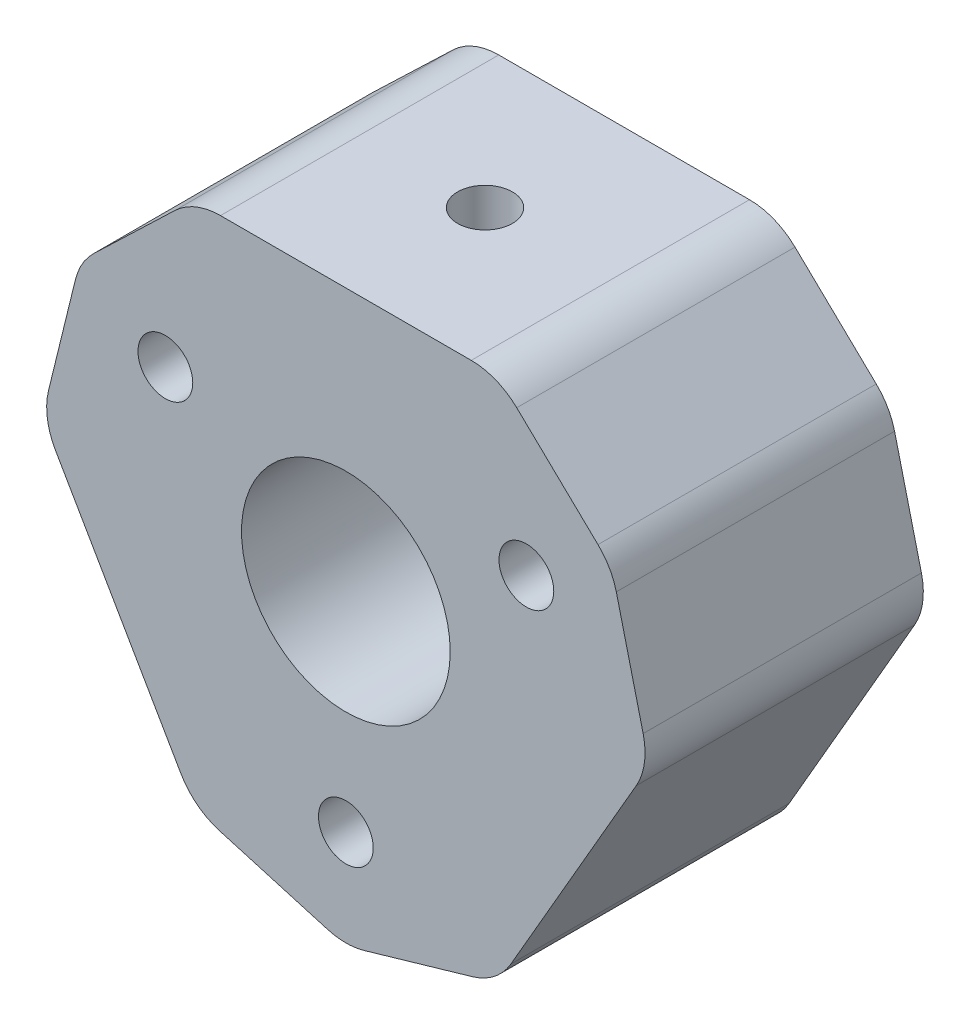
ISO-10303-21;
HEADER;
FILE_DESCRIPTION(('STEP AP214'),'2;1');
FILE_NAME('part.step','',(''),(''),'','','');
FILE_SCHEMA(('AUTOMOTIVE_DESIGN { 1 0 10303 214 1 1 1 1 }'));
ENDSEC;
DATA;
#1=APPLICATION_CONTEXT('core data for automotive mechanical design processes');
#2=APPLICATION_PROTOCOL_DEFINITION('international standard','automotive_design',2000,#1);
#3=PRODUCT_CONTEXT('',#1,'mechanical');
#4=PRODUCT('Part','Part','',(#3));
#5=PRODUCT_RELATED_PRODUCT_CATEGORY('part','',(#4));
#6=PRODUCT_DEFINITION_FORMATION('','',#4);
#7=PRODUCT_DEFINITION_CONTEXT('part definition',#1,'design');
#8=PRODUCT_DEFINITION('design','',#6,#7);
#9=PRODUCT_DEFINITION_SHAPE('','',#8);
#10=(LENGTH_UNIT() NAMED_UNIT(*) SI_UNIT(.MILLI.,.METRE.));
#11=(NAMED_UNIT(*) PLANE_ANGLE_UNIT() SI_UNIT($,.RADIAN.));
#12=(NAMED_UNIT(*) SI_UNIT($,.STERADIAN.) SOLID_ANGLE_UNIT());
#13=UNCERTAINTY_MEASURE_WITH_UNIT(LENGTH_MEASURE(1.E-05),#10,'distance_accuracy_value','');
#14=(GEOMETRIC_REPRESENTATION_CONTEXT(3) GLOBAL_UNCERTAINTY_ASSIGNED_CONTEXT((#13)) GLOBAL_UNIT_ASSIGNED_CONTEXT((#10,
#11,#12)) REPRESENTATION_CONTEXT('',''));
#15=CARTESIAN_POINT('',(0.,0.,0.));
#16=DIRECTION('',(0.,0.,1.));
#17=DIRECTION('',(1.,0.,0.));
#18=AXIS2_PLACEMENT_3D('',#15,#16,#17);
#19=CARTESIAN_POINT('',(0.,-10.888495471054,12.7));
#20=DIRECTION('',(0.,0.,1.));
#21=DIRECTION('',(1.,0.,0.));
#22=AXIS2_PLACEMENT_3D('',#19,#20,#21);
#23=PLANE('',#22);
#24=CARTESIAN_POINT('',(8.23806665349945,4.75625000000004,12.7));
#25=DIRECTION('',(0.,0.,1.));
#26=DIRECTION('',(1.,0.,0.));
#27=AXIS2_PLACEMENT_3D('',#24,#25,#26);
#28=CIRCLE('',#27,1.25);
#29=CARTESIAN_POINT('',(9.48806665349945,4.75625000000004,12.7));
#30=VERTEX_POINT('',#29);
#31=EDGE_CURVE('E392',#30,#30,#28,.T.);
#32=ORIENTED_EDGE('',*,*,#31,.F.);
#33=EDGE_LOOP('',(#32));
#34=FACE_BOUND('',#33,.T.);
#35=CARTESIAN_POINT('',(0.,0.,12.7));
#36=DIRECTION('',(0.,0.,1.));
#37=DIRECTION('',(1.,0.,0.));
#38=AXIS2_PLACEMENT_3D('',#35,#36,#37);
#39=CIRCLE('',#38,4.7625);
#40=CARTESIAN_POINT('',(4.7625,0.,12.7));
#41=VERTEX_POINT('',#40);
#42=EDGE_CURVE('E208',#41,#41,#39,.T.);
#43=ORIENTED_EDGE('',*,*,#42,.F.);
#44=EDGE_LOOP('',(#43));
#45=FACE_BOUND('',#44,.T.);
#46=CARTESIAN_POINT('',(0.,-10.888495471054,12.7));
#47=DIRECTION('',(0.,0.,1.));
#48=DIRECTION('',(1.,0.,0.));
#49=AXIS2_PLACEMENT_3D('',#46,#47,#48);
#50=CIRCLE('',#49,3.);
#51=CARTESIAN_POINT('',(-0.836847118322298,-13.7694131895173,12.7));
#52=VERTEX_POINT('',#51);
#53=CARTESIAN_POINT('',(0.836847118322313,-13.7694131895173,12.7));
#54=VERTEX_POINT('',#53);
#55=EDGE_CURVE('E239',#52,#54,#50,.T.);
#56=ORIENTED_EDGE('',*,*,#55,.T.);
#57=DIRECTION('',(0.960305906154426,0.278949039440768,0.));
#58=VECTOR('',#57,1.);
#59=CARTESIAN_POINT('',(0.836847118322313,-13.7694131895173,12.7));
#60=LINE('',#59,#58);
#61=CARTESIAN_POINT('',(5.77000843492431,-12.3364316761752,12.7));
#62=VERTEX_POINT('',#61);
#63=EDGE_CURVE('E137',#54,#62,#60,.T.);
#64=ORIENTED_EDGE('',*,*,#63,.T.);
#65=CARTESIAN_POINT('',(4.93316131660201,-9.45551395771196,12.7));
#66=DIRECTION('',(0.,0.,1.));
#67=DIRECTION('',(1.,0.,0.));
#68=AXIS2_PLACEMENT_3D('',#65,#66,#67);
#69=CIRCLE('',#68,3.);
#70=CARTESIAN_POINT('',(7.53123752795532,-10.955513957712,12.7));
#71=VERTEX_POINT('',#70);
#72=EDGE_CURVE('E284',#62,#71,#69,.T.);
#73=ORIENTED_EDGE('',*,*,#72,.T.);
#74=DIRECTION('',(0.499999999999999,0.866025403784439,0.));
#75=VECTOR('',#74,1.);
#76=CARTESIAN_POINT('',(7.53123752795532,-10.955513957712,12.7));
#77=LINE('',#76,#75);
#78=CARTESIAN_POINT('',(13.2533721628712,-1.04448604228802,12.7));
#79=VERTEX_POINT('',#78);
#80=EDGE_CURVE('E303',#71,#79,#77,.T.);
#81=ORIENTED_EDGE('',*,*,#80,.T.);
#82=CARTESIAN_POINT('',(10.6552959515179,0.455513957711976,12.7));
#83=DIRECTION('',(0.,0.,1.));
#84=DIRECTION('',(1.,0.,0.));
#85=AXIS2_PLACEMENT_3D('',#82,#83,#84);
#86=CIRCLE('',#85,3.);
#87=CARTESIAN_POINT('',(13.568667441081,1.17124195339269,12.7));
#88=VERTEX_POINT('',#87);
#89=EDGE_CURVE('E300',#79,#88,#86,.T.);
#90=ORIENTED_EDGE('',*,*,#89,.T.);
#91=DIRECTION('',(-0.238575998560237,0.971123829854353,0.));
#92=VECTOR('',#91,1.);
#93=CARTESIAN_POINT('',(12.3430851764877,6.15997573120774,12.7));
#94=LINE('',#93,#92);
#95=CARTESIAN_POINT('',(12.3430851764877,6.15997573120774,12.7));
#96=VERTEX_POINT('',#95);
#97=EDGE_CURVE('E302',#88,#96,#94,.T.);
#98=ORIENTED_EDGE('',*,*,#97,.T.);
#99=CARTESIAN_POINT('',(9.42971368692461,5.44424773552703,12.7));
#100=DIRECTION('',(0.,0.,1.));
#101=DIRECTION('',(-1.,0.,0.));
#102=AXIS2_PLACEMENT_3D('',#99,#100,#101);
#103=CIRCLE('',#102,3.);
#104=CARTESIAN_POINT('',(11.5062380581653,7.60943745830959,12.7));
#105=VERTEX_POINT('',#104);
#106=EDGE_CURVE('E305',#96,#105,#103,.T.);
#107=ORIENTED_EDGE('',*,*,#106,.T.);
#108=DIRECTION('',(-0.721729907594188,0.692174790413581,0.));
#109=VECTOR('',#108,1.);
#110=CARTESIAN_POINT('',(7.79865900615664,11.1651897227826,12.7));
#111=LINE('',#110,#109);
#112=CARTESIAN_POINT('',(7.79865900615664,11.1651897227826,12.7));
#113=VERTEX_POINT('',#112);
#114=EDGE_CURVE('E311',#105,#113,#111,.T.);
#115=ORIENTED_EDGE('',*,*,#114,.T.);
#116=CARTESIAN_POINT('',(5.7221346349159,9.,12.7));
#117=DIRECTION('',(0.,0.,1.));
#118=DIRECTION('',(1.,0.,0.));
#119=AXIS2_PLACEMENT_3D('',#116,#117,#118);
#120=CIRCLE('',#119,3.);
#121=CARTESIAN_POINT('',(5.7221346349159,12.,12.7));
#122=VERTEX_POINT('',#121);
#123=EDGE_CURVE('E313',#113,#122,#120,.T.);
#124=ORIENTED_EDGE('',*,*,#123,.T.);
#125=DIRECTION('',(-1.,0.,0.));
#126=VECTOR('',#125,1.);
#127=CARTESIAN_POINT('',(5.7221346349159,12.,12.7));
#128=LINE('',#127,#126);
#129=CARTESIAN_POINT('',(-5.7221346349159,12.,12.7));
#130=VERTEX_POINT('',#129);
#131=EDGE_CURVE('E315',#122,#130,#128,.T.);
#132=ORIENTED_EDGE('',*,*,#131,.T.);
#133=CARTESIAN_POINT('',(-5.7221346349159,9.,12.7));
#134=DIRECTION('',(0.,0.,1.));
#135=DIRECTION('',(1.,0.,0.));
#136=AXIS2_PLACEMENT_3D('',#133,#134,#135);
#137=CIRCLE('',#136,3.);
#138=CARTESIAN_POINT('',(-7.79865900615666,11.1651897227825,12.7));
#139=VERTEX_POINT('',#138);
#140=EDGE_CURVE('E317',#130,#139,#137,.T.);
#141=ORIENTED_EDGE('',*,*,#140,.T.);
#142=DIRECTION('',(-0.721729907594183,-0.692174790413586,0.));
#143=VECTOR('',#142,1.);
#144=CARTESIAN_POINT('',(-7.79865900615666,11.1651897227825,12.7));
#145=LINE('',#144,#143);
#146=CARTESIAN_POINT('',(-11.5062380581653,7.60943745830954,12.7));
#147=VERTEX_POINT('',#146);
#148=EDGE_CURVE('E319',#139,#147,#145,.T.);
#149=ORIENTED_EDGE('',*,*,#148,.T.);
#150=CARTESIAN_POINT('',(-9.42971368692457,5.44424773552699,12.7));
#151=DIRECTION('',(0.,0.,1.));
#152=DIRECTION('',(1.,0.,0.));
#153=AXIS2_PLACEMENT_3D('',#150,#151,#152);
#154=CIRCLE('',#153,3.);
#155=CARTESIAN_POINT('',(-12.3430851764876,6.15997573120772,12.7));
#156=VERTEX_POINT('',#155);
#157=EDGE_CURVE('E321',#147,#156,#154,.T.);
#158=ORIENTED_EDGE('',*,*,#157,.T.);
#159=DIRECTION('',(-0.238575998560243,-0.971123829854351,0.));
#160=VECTOR('',#159,1.);
#161=CARTESIAN_POINT('',(-12.3430851764876,6.15997573120772,12.7));
#162=LINE('',#161,#160);
#163=CARTESIAN_POINT('',(-13.5686674410809,1.17124195339268,12.7));
#164=VERTEX_POINT('',#163);
#165=EDGE_CURVE('E323',#156,#164,#162,.T.);
#166=ORIENTED_EDGE('',*,*,#165,.T.);
#167=CARTESIAN_POINT('',(-10.6552959515179,0.455513957711953,12.7));
#168=DIRECTION('',(0.,0.,1.));
#169=DIRECTION('',(-1.,0.,0.));
#170=AXIS2_PLACEMENT_3D('',#167,#168,#169);
#171=CIRCLE('',#170,3.);
#172=CARTESIAN_POINT('',(-13.2533721628712,-1.04448604228805,12.7));
#173=VERTEX_POINT('',#172);
#174=EDGE_CURVE('E186',#164,#173,#171,.T.);
#175=ORIENTED_EDGE('',*,*,#174,.T.);
#176=DIRECTION('',(0.5,-0.866025403784438,0.));
#177=VECTOR('',#176,1.);
#178=CARTESIAN_POINT('',(-13.2533721628712,-1.04448604228805,12.7));
#179=LINE('',#178,#177);
#180=CARTESIAN_POINT('',(-7.53123752795531,-10.955513957712,12.7));
#181=VERTEX_POINT('',#180);
#182=EDGE_CURVE('E180',#173,#181,#179,.T.);
#183=ORIENTED_EDGE('',*,*,#182,.T.);
#184=CARTESIAN_POINT('',(-4.93316131660199,-9.45551395771196,12.7));
#185=DIRECTION('',(0.,0.,1.));
#186=DIRECTION('',(1.,0.,0.));
#187=AXIS2_PLACEMENT_3D('',#184,#185,#186);
#188=CIRCLE('',#187,3.);
#189=CARTESIAN_POINT('',(-5.7700084349243,-12.3364316761752,12.7));
#190=VERTEX_POINT('',#189);
#191=EDGE_CURVE('E184',#181,#190,#188,.T.);
#192=ORIENTED_EDGE('',*,*,#191,.T.);
#193=DIRECTION('',(0.960305906154426,-0.278949039440768,0.));
#194=VECTOR('',#193,1.);
#195=CARTESIAN_POINT('',(-5.7700084349243,-12.3364316761752,12.7));
#196=LINE('',#195,#194);
#197=EDGE_CURVE('E64',#190,#52,#196,.T.);
#198=ORIENTED_EDGE('',*,*,#197,.T.);
#199=EDGE_LOOP('',(#56,#64,#73,#81,#90,#98,#107,#115,#124,#132,#141,#149,#158,#166,#175,#183,
#192,#198));
#200=FACE_BOUND('',#199,.T.);
#201=CARTESIAN_POINT('',(-8.23806665349949,4.75624999999998,12.7));
#202=DIRECTION('',(0.,0.,1.));
#203=DIRECTION('',(1.,0.,0.));
#204=AXIS2_PLACEMENT_3D('',#201,#202,#203);
#205=CIRCLE('',#204,1.25);
#206=CARTESIAN_POINT('',(-6.98806665349949,4.75624999999998,12.7));
#207=VERTEX_POINT('',#206);
#208=EDGE_CURVE('E398',#207,#207,#205,.T.);
#209=ORIENTED_EDGE('',*,*,#208,.F.);
#210=EDGE_LOOP('',(#209));
#211=FACE_BOUND('',#210,.T.);
#212=CARTESIAN_POINT('',(0.,-9.5125,12.7));
#213=DIRECTION('',(0.,0.,1.));
#214=DIRECTION('',(1.,0.,0.));
#215=AXIS2_PLACEMENT_3D('',#212,#213,#214);
#216=CIRCLE('',#215,1.25);
#217=CARTESIAN_POINT('',(1.25,-9.5125,12.7));
#218=VERTEX_POINT('',#217);
#219=EDGE_CURVE('E386',#218,#218,#216,.T.);
#220=ORIENTED_EDGE('',*,*,#219,.F.);
#221=EDGE_LOOP('',(#220));
#222=FACE_BOUND('',#221,.T.);
#223=ADVANCED_FACE('F47',(#34,#45,#200,#211,#222),#23,.T.);
#224=CARTESIAN_POINT('',(0.,-10.888495471054,0.));
#225=DIRECTION('',(0.,0.,1.));
#226=DIRECTION('',(1.,0.,0.));
#227=AXIS2_PLACEMENT_3D('',#224,#225,#226);
#228=PLANE('',#227);
#229=CARTESIAN_POINT('',(0.,-10.888495471054,0.));
#230=DIRECTION('',(0.,0.,1.));
#231=DIRECTION('',(1.,0.,0.));
#232=AXIS2_PLACEMENT_3D('',#229,#230,#231);
#233=CIRCLE('',#232,3.);
#234=CARTESIAN_POINT('',(-0.836847118322298,-13.7694131895173,0.));
#235=VERTEX_POINT('',#234);
#236=CARTESIAN_POINT('',(0.836847118322313,-13.7694131895173,0.));
#237=VERTEX_POINT('',#236);
#238=EDGE_CURVE('E204',#235,#237,#233,.T.);
#239=ORIENTED_EDGE('',*,*,#238,.F.);
#240=DIRECTION('',(0.960305906154426,-0.278949039440768,0.));
#241=VECTOR('',#240,1.);
#242=CARTESIAN_POINT('',(-5.7700084349243,-12.3364316761752,0.));
#243=LINE('',#242,#241);
#244=CARTESIAN_POINT('',(-5.7700084349243,-12.3364316761752,0.));
#245=VERTEX_POINT('',#244);
#246=EDGE_CURVE('E129',#245,#235,#243,.T.);
#247=ORIENTED_EDGE('',*,*,#246,.F.);
#248=CARTESIAN_POINT('',(-4.93316131660199,-9.45551395771196,0.));
#249=DIRECTION('',(0.,0.,1.));
#250=DIRECTION('',(1.,0.,0.));
#251=AXIS2_PLACEMENT_3D('',#248,#249,#250);
#252=CIRCLE('',#251,3.);
#253=CARTESIAN_POINT('',(-7.53123752795531,-10.955513957712,0.));
#254=VERTEX_POINT('',#253);
#255=EDGE_CURVE('E123',#254,#245,#252,.T.);
#256=ORIENTED_EDGE('',*,*,#255,.F.);
#257=DIRECTION('',(0.5,-0.866025403784438,0.));
#258=VECTOR('',#257,1.);
#259=CARTESIAN_POINT('',(-13.2533721628712,-1.04448604228805,0.));
#260=LINE('',#259,#258);
#261=CARTESIAN_POINT('',(-13.2533721628712,-1.04448604228805,0.));
#262=VERTEX_POINT('',#261);
#263=EDGE_CURVE('E194',#262,#254,#260,.T.);
#264=ORIENTED_EDGE('',*,*,#263,.F.);
#265=CARTESIAN_POINT('',(-10.6552959515179,0.455513957711953,0.));
#266=DIRECTION('',(0.,0.,1.));
#267=DIRECTION('',(-1.,0.,0.));
#268=AXIS2_PLACEMENT_3D('',#265,#266,#267);
#269=CIRCLE('',#268,3.);
#270=CARTESIAN_POINT('',(-13.5686674410809,1.17124195339268,0.));
#271=VERTEX_POINT('',#270);
#272=EDGE_CURVE('E234',#271,#262,#269,.T.);
#273=ORIENTED_EDGE('',*,*,#272,.F.);
#274=DIRECTION('',(-0.238575998560243,-0.971123829854351,0.));
#275=VECTOR('',#274,1.);
#276=CARTESIAN_POINT('',(-12.3430851764876,6.15997573120772,0.));
#277=LINE('',#276,#275);
#278=CARTESIAN_POINT('',(-12.3430851764876,6.15997573120772,0.));
#279=VERTEX_POINT('',#278);
#280=EDGE_CURVE('E232',#279,#271,#277,.T.);
#281=ORIENTED_EDGE('',*,*,#280,.F.);
#282=CARTESIAN_POINT('',(-9.42971368692457,5.44424773552699,0.));
#283=DIRECTION('',(0.,0.,1.));
#284=DIRECTION('',(1.,0.,0.));
#285=AXIS2_PLACEMENT_3D('',#282,#283,#284);
#286=CIRCLE('',#285,3.);
#287=CARTESIAN_POINT('',(-11.5062380581653,7.60943745830954,0.));
#288=VERTEX_POINT('',#287);
#289=EDGE_CURVE('E230',#288,#279,#286,.T.);
#290=ORIENTED_EDGE('',*,*,#289,.F.);
#291=DIRECTION('',(-0.721729907594183,-0.692174790413586,0.));
#292=VECTOR('',#291,1.);
#293=CARTESIAN_POINT('',(-7.79865900615666,11.1651897227825,0.));
#294=LINE('',#293,#292);
#295=CARTESIAN_POINT('',(-7.79865900615666,11.1651897227825,0.));
#296=VERTEX_POINT('',#295);
#297=EDGE_CURVE('E228',#296,#288,#294,.T.);
#298=ORIENTED_EDGE('',*,*,#297,.F.);
#299=CARTESIAN_POINT('',(-5.7221346349159,9.,0.));
#300=DIRECTION('',(0.,0.,1.));
#301=DIRECTION('',(1.,0.,0.));
#302=AXIS2_PLACEMENT_3D('',#299,#300,#301);
#303=CIRCLE('',#302,3.);
#304=CARTESIAN_POINT('',(-5.7221346349159,12.,0.));
#305=VERTEX_POINT('',#304);
#306=EDGE_CURVE('E226',#305,#296,#303,.T.);
#307=ORIENTED_EDGE('',*,*,#306,.F.);
#308=DIRECTION('',(-1.,0.,0.));
#309=VECTOR('',#308,1.);
#310=CARTESIAN_POINT('',(5.7221346349159,12.,0.));
#311=LINE('',#310,#309);
#312=CARTESIAN_POINT('',(5.7221346349159,12.,0.));
#313=VERTEX_POINT('',#312);
#314=EDGE_CURVE('E224',#313,#305,#311,.T.);
#315=ORIENTED_EDGE('',*,*,#314,.F.);
#316=CARTESIAN_POINT('',(5.7221346349159,9.,0.));
#317=DIRECTION('',(0.,0.,1.));
#318=DIRECTION('',(1.,0.,0.));
#319=AXIS2_PLACEMENT_3D('',#316,#317,#318);
#320=CIRCLE('',#319,3.);
#321=CARTESIAN_POINT('',(7.79865900615664,11.1651897227826,0.));
#322=VERTEX_POINT('',#321);
#323=EDGE_CURVE('E222',#322,#313,#320,.T.);
#324=ORIENTED_EDGE('',*,*,#323,.F.);
#325=DIRECTION('',(-0.721729907594188,0.692174790413581,0.));
#326=VECTOR('',#325,1.);
#327=CARTESIAN_POINT('',(7.79865900615664,11.1651897227826,0.));
#328=LINE('',#327,#326);
#329=CARTESIAN_POINT('',(11.5062380581653,7.60943745830959,0.));
#330=VERTEX_POINT('',#329);
#331=EDGE_CURVE('E220',#330,#322,#328,.T.);
#332=ORIENTED_EDGE('',*,*,#331,.F.);
#333=CARTESIAN_POINT('',(9.42971368692461,5.44424773552703,0.));
#334=DIRECTION('',(0.,0.,1.));
#335=DIRECTION('',(-1.,0.,0.));
#336=AXIS2_PLACEMENT_3D('',#333,#334,#335);
#337=CIRCLE('',#336,3.);
#338=CARTESIAN_POINT('',(12.3430851764877,6.15997573120774,0.));
#339=VERTEX_POINT('',#338);
#340=EDGE_CURVE('E218',#339,#330,#337,.T.);
#341=ORIENTED_EDGE('',*,*,#340,.F.);
#342=DIRECTION('',(-0.238575998560237,0.971123829854353,0.));
#343=VECTOR('',#342,1.);
#344=CARTESIAN_POINT('',(12.3430851764877,6.15997573120774,0.));
#345=LINE('',#344,#343);
#346=CARTESIAN_POINT('',(13.568667441081,1.17124195339269,0.));
#347=VERTEX_POINT('',#346);
#348=EDGE_CURVE('E216',#347,#339,#345,.T.);
#349=ORIENTED_EDGE('',*,*,#348,.F.);
#350=CARTESIAN_POINT('',(10.6552959515179,0.455513957711976,0.));
#351=DIRECTION('',(0.,0.,1.));
#352=DIRECTION('',(1.,0.,0.));
#353=AXIS2_PLACEMENT_3D('',#350,#351,#352);
#354=CIRCLE('',#353,3.);
#355=CARTESIAN_POINT('',(13.2533721628712,-1.04448604228802,0.));
#356=VERTEX_POINT('',#355);
#357=EDGE_CURVE('E214',#356,#347,#354,.T.);
#358=ORIENTED_EDGE('',*,*,#357,.F.);
#359=DIRECTION('',(0.499999999999999,0.866025403784439,0.));
#360=VECTOR('',#359,1.);
#361=CARTESIAN_POINT('',(7.53123752795532,-10.955513957712,0.));
#362=LINE('',#361,#360);
#363=CARTESIAN_POINT('',(7.53123752795532,-10.955513957712,0.));
#364=VERTEX_POINT('',#363);
#365=EDGE_CURVE('E212',#364,#356,#362,.T.);
#366=ORIENTED_EDGE('',*,*,#365,.F.);
#367=CARTESIAN_POINT('',(4.93316131660201,-9.45551395771196,0.));
#368=DIRECTION('',(0.,0.,1.));
#369=DIRECTION('',(1.,0.,0.));
#370=AXIS2_PLACEMENT_3D('',#367,#368,#369);
#371=CIRCLE('',#370,3.);
#372=CARTESIAN_POINT('',(5.77000843492431,-12.3364316761752,0.));
#373=VERTEX_POINT('',#372);
#374=EDGE_CURVE('E210',#373,#364,#371,.T.);
#375=ORIENTED_EDGE('',*,*,#374,.F.);
#376=DIRECTION('',(0.960305906154426,0.278949039440768,0.));
#377=VECTOR('',#376,1.);
#378=CARTESIAN_POINT('',(0.836847118322313,-13.7694131895173,0.));
#379=LINE('',#378,#377);
#380=EDGE_CURVE('E207',#237,#373,#379,.T.);
#381=ORIENTED_EDGE('',*,*,#380,.F.);
#382=EDGE_LOOP('',(#239,#247,#256,#264,#273,#281,#290,#298,#307,#315,#324,#332,#341,#349,#358,
#366,#375,#381));
#383=FACE_BOUND('',#382,.T.);
#384=CARTESIAN_POINT('',(0.,0.,0.));
#385=DIRECTION('',(0.,0.,1.));
#386=DIRECTION('',(1.,0.,0.));
#387=AXIS2_PLACEMENT_3D('',#384,#385,#386);
#388=CIRCLE('',#387,4.7625);
#389=CARTESIAN_POINT('',(4.7625,0.,0.));
#390=VERTEX_POINT('',#389);
#391=EDGE_CURVE('E401',#390,#390,#388,.T.);
#392=ORIENTED_EDGE('',*,*,#391,.T.);
#393=EDGE_LOOP('',(#392));
#394=FACE_BOUND('',#393,.T.);
#395=CARTESIAN_POINT('',(-8.23806665349949,4.75624999999998,0.));
#396=DIRECTION('',(0.,0.,1.));
#397=DIRECTION('',(1.,0.,0.));
#398=AXIS2_PLACEMENT_3D('',#395,#396,#397);
#399=CIRCLE('',#398,1.25);
#400=CARTESIAN_POINT('',(-6.98806665349949,4.75624999999998,0.));
#401=VERTEX_POINT('',#400);
#402=EDGE_CURVE('E395',#401,#401,#399,.T.);
#403=ORIENTED_EDGE('',*,*,#402,.T.);
#404=EDGE_LOOP('',(#403));
#405=FACE_BOUND('',#404,.T.);
#406=CARTESIAN_POINT('',(8.23806665349945,4.75625000000004,0.));
#407=DIRECTION('',(0.,0.,1.));
#408=DIRECTION('',(1.,0.,0.));
#409=AXIS2_PLACEMENT_3D('',#406,#407,#408);
#410=CIRCLE('',#409,1.25);
#411=CARTESIAN_POINT('',(9.48806665349945,4.75625000000004,0.));
#412=VERTEX_POINT('',#411);
#413=EDGE_CURVE('E389',#412,#412,#410,.T.);
#414=ORIENTED_EDGE('',*,*,#413,.T.);
#415=EDGE_LOOP('',(#414));
#416=FACE_BOUND('',#415,.T.);
#417=CARTESIAN_POINT('',(0.,-9.5125,0.));
#418=DIRECTION('',(0.,0.,1.));
#419=DIRECTION('',(1.,0.,0.));
#420=AXIS2_PLACEMENT_3D('',#417,#418,#419);
#421=CIRCLE('',#420,1.25);
#422=CARTESIAN_POINT('',(1.25,-9.5125,0.));
#423=VERTEX_POINT('',#422);
#424=EDGE_CURVE('E384',#423,#423,#421,.T.);
#425=ORIENTED_EDGE('',*,*,#424,.T.);
#426=EDGE_LOOP('',(#425));
#427=FACE_BOUND('',#426,.T.);
#428=ADVANCED_FACE('F288',(#383,#394,#405,#416,#427),#228,.F.);
#429=CARTESIAN_POINT('',(0.,-10.888495471054,12.7));
#430=DIRECTION('',(0.,0.,-1.));
#431=DIRECTION('',(-1.,0.,0.));
#432=AXIS2_PLACEMENT_3D('',#429,#430,#431);
#433=CYLINDRICAL_SURFACE('',#432,3.);
#434=ORIENTED_EDGE('',*,*,#238,.T.);
#435=DIRECTION('',(0.,0.,-1.));
#436=VECTOR('',#435,1.);
#437=CARTESIAN_POINT('',(0.836847118322313,-13.7694131895173,12.7));
#438=LINE('',#437,#436);
#439=EDGE_CURVE('E12',#54,#237,#438,.T.);
#440=ORIENTED_EDGE('',*,*,#439,.F.);
#441=ORIENTED_EDGE('',*,*,#55,.F.);
#442=DIRECTION('',(0.,0.,-1.));
#443=VECTOR('',#442,1.);
#444=CARTESIAN_POINT('',(-0.836847118322298,-13.7694131895173,12.7));
#445=LINE('',#444,#443);
#446=EDGE_CURVE('E200',#52,#235,#445,.T.);
#447=ORIENTED_EDGE('',*,*,#446,.T.);
#448=EDGE_LOOP('',(#434,#440,#441,#447));
#449=FACE_BOUND('',#448,.T.);
#450=ADVANCED_FACE('F49',(#449),#433,.T.);
#451=CARTESIAN_POINT('',(0.836847118322313,-13.7694131895173,12.7));
#452=DIRECTION('',(-0.278949039440768,0.960305906154426,0.));
#453=DIRECTION('',(-0.960305906154426,-0.278949039440768,0.));
#454=AXIS2_PLACEMENT_3D('',#451,#452,#453);
#455=PLANE('',#454);
#456=ORIENTED_EDGE('',*,*,#380,.T.);
#457=DIRECTION('',(0.,0.,-1.));
#458=VECTOR('',#457,1.);
#459=CARTESIAN_POINT('',(5.77000843492431,-12.3364316761752,12.7));
#460=LINE('',#459,#458);
#461=EDGE_CURVE('E56',#62,#373,#460,.T.);
#462=ORIENTED_EDGE('',*,*,#461,.F.);
#463=ORIENTED_EDGE('',*,*,#63,.F.);
#464=ORIENTED_EDGE('',*,*,#439,.T.);
#465=EDGE_LOOP('',(#456,#462,#463,#464));
#466=FACE_BOUND('',#465,.T.);
#467=ADVANCED_FACE('F484',(#466),#455,.F.);
#468=CARTESIAN_POINT('',(4.93316131660201,-9.45551395771196,12.7));
#469=DIRECTION('',(0.,0.,-1.));
#470=DIRECTION('',(-1.,0.,0.));
#471=AXIS2_PLACEMENT_3D('',#468,#469,#470);
#472=CYLINDRICAL_SURFACE('',#471,3.);
#473=ORIENTED_EDGE('',*,*,#374,.T.);
#474=DIRECTION('',(0.,0.,-1.));
#475=VECTOR('',#474,1.);
#476=CARTESIAN_POINT('',(7.53123752795532,-10.955513957712,12.7));
#477=LINE('',#476,#475);
#478=EDGE_CURVE('E276',#71,#364,#477,.T.);
#479=ORIENTED_EDGE('',*,*,#478,.F.);
#480=ORIENTED_EDGE('',*,*,#72,.F.);
#481=ORIENTED_EDGE('',*,*,#461,.T.);
#482=EDGE_LOOP('',(#473,#479,#480,#481));
#483=FACE_BOUND('',#482,.T.);
#484=ADVANCED_FACE('F282',(#483),#472,.T.);
#485=CARTESIAN_POINT('',(7.53123752795532,-10.955513957712,12.7));
#486=DIRECTION('',(-0.866025403784439,0.499999999999999,0.));
#487=DIRECTION('',(-0.499999999999999,-0.866025403784439,0.));
#488=AXIS2_PLACEMENT_3D('',#485,#486,#487);
#489=PLANE('',#488);
#490=ORIENTED_EDGE('',*,*,#365,.T.);
#491=DIRECTION('',(0.,0.,-1.));
#492=VECTOR('',#491,1.);
#493=CARTESIAN_POINT('',(13.2533721628712,-1.04448604228802,12.7));
#494=LINE('',#493,#492);
#495=EDGE_CURVE('E273',#79,#356,#494,.T.);
#496=ORIENTED_EDGE('',*,*,#495,.F.);
#497=ORIENTED_EDGE('',*,*,#80,.F.);
#498=ORIENTED_EDGE('',*,*,#478,.T.);
#499=EDGE_LOOP('',(#490,#496,#497,#498));
#500=FACE_BOUND('',#499,.T.);
#501=ADVANCED_FACE('F294',(#500),#489,.F.);
#502=CARTESIAN_POINT('',(10.6552959515179,0.455513957711976,12.7));
#503=DIRECTION('',(0.,0.,-1.));
#504=DIRECTION('',(-1.,0.,0.));
#505=AXIS2_PLACEMENT_3D('',#502,#503,#504);
#506=CYLINDRICAL_SURFACE('',#505,3.);
#507=ORIENTED_EDGE('',*,*,#357,.T.);
#508=DIRECTION('',(0.,0.,-1.));
#509=VECTOR('',#508,1.);
#510=CARTESIAN_POINT('',(13.568667441081,1.17124195339269,12.7));
#511=LINE('',#510,#509);
#512=EDGE_CURVE('E270',#88,#347,#511,.T.);
#513=ORIENTED_EDGE('',*,*,#512,.F.);
#514=ORIENTED_EDGE('',*,*,#89,.F.);
#515=ORIENTED_EDGE('',*,*,#495,.T.);
#516=EDGE_LOOP('',(#507,#513,#514,#515));
#517=FACE_BOUND('',#516,.T.);
#518=ADVANCED_FACE('F298',(#517),#506,.T.);
#519=CARTESIAN_POINT('',(12.3430851764877,6.15997573120774,12.7));
#520=DIRECTION('',(-0.971123829854353,-0.238575998560237,0.));
#521=DIRECTION('',(0.238575998560237,-0.971123829854353,0.));
#522=AXIS2_PLACEMENT_3D('',#519,#520,#521);
#523=PLANE('',#522);
#524=ORIENTED_EDGE('',*,*,#348,.T.);
#525=DIRECTION('',(0.,0.,-1.));
#526=VECTOR('',#525,1.);
#527=CARTESIAN_POINT('',(12.3430851764877,6.15997573120774,12.7));
#528=LINE('',#527,#526);
#529=EDGE_CURVE('E267',#96,#339,#528,.T.);
#530=ORIENTED_EDGE('',*,*,#529,.F.);
#531=ORIENTED_EDGE('',*,*,#97,.F.);
#532=ORIENTED_EDGE('',*,*,#512,.T.);
#533=EDGE_LOOP('',(#524,#530,#531,#532));
#534=FACE_BOUND('',#533,.T.);
#535=ADVANCED_FACE('F474',(#534),#523,.F.);
#536=CARTESIAN_POINT('',(9.42971368692461,5.44424773552703,12.7));
#537=DIRECTION('',(0.,0.,-1.));
#538=DIRECTION('',(-1.,0.,0.));
#539=AXIS2_PLACEMENT_3D('',#536,#537,#538);
#540=CYLINDRICAL_SURFACE('',#539,3.);
#541=ORIENTED_EDGE('',*,*,#340,.T.);
#542=DIRECTION('',(0.,0.,-1.));
#543=VECTOR('',#542,1.);
#544=CARTESIAN_POINT('',(11.5062380581653,7.60943745830959,12.7));
#545=LINE('',#544,#543);
#546=EDGE_CURVE('E264',#105,#330,#545,.T.);
#547=ORIENTED_EDGE('',*,*,#546,.F.);
#548=ORIENTED_EDGE('',*,*,#106,.F.);
#549=ORIENTED_EDGE('',*,*,#529,.T.);
#550=EDGE_LOOP('',(#541,#547,#548,#549));
#551=FACE_BOUND('',#550,.T.);
#552=ADVANCED_FACE('F470',(#551),#540,.T.);
#553=CARTESIAN_POINT('',(7.79865900615664,11.1651897227826,12.7));
#554=DIRECTION('',(-0.692174790413581,-0.721729907594188,0.));
#555=DIRECTION('',(0.721729907594188,-0.692174790413581,0.));
#556=AXIS2_PLACEMENT_3D('',#553,#554,#555);
#557=PLANE('',#556);
#558=ORIENTED_EDGE('',*,*,#331,.T.);
#559=DIRECTION('',(0.,0.,-1.));
#560=VECTOR('',#559,1.);
#561=CARTESIAN_POINT('',(7.79865900615664,11.1651897227826,12.7));
#562=LINE('',#561,#560);
#563=EDGE_CURVE('E261',#113,#322,#562,.T.);
#564=ORIENTED_EDGE('',*,*,#563,.F.);
#565=ORIENTED_EDGE('',*,*,#114,.F.);
#566=ORIENTED_EDGE('',*,*,#546,.T.);
#567=EDGE_LOOP('',(#558,#564,#565,#566));
#568=FACE_BOUND('',#567,.T.);
#569=ADVANCED_FACE('F466',(#568),#557,.F.);
#570=CARTESIAN_POINT('',(5.7221346349159,9.,12.7));
#571=DIRECTION('',(0.,0.,-1.));
#572=DIRECTION('',(-1.,0.,0.));
#573=AXIS2_PLACEMENT_3D('',#570,#571,#572);
#574=CYLINDRICAL_SURFACE('',#573,3.);
#575=ORIENTED_EDGE('',*,*,#323,.T.);
#576=DIRECTION('',(0.,0.,-1.));
#577=VECTOR('',#576,1.);
#578=CARTESIAN_POINT('',(5.7221346349159,12.,12.7));
#579=LINE('',#578,#577);
#580=EDGE_CURVE('E258',#122,#313,#579,.T.);
#581=ORIENTED_EDGE('',*,*,#580,.F.);
#582=ORIENTED_EDGE('',*,*,#123,.F.);
#583=ORIENTED_EDGE('',*,*,#563,.T.);
#584=EDGE_LOOP('',(#575,#581,#582,#583));
#585=FACE_BOUND('',#584,.T.);
#586=ADVANCED_FACE('F433',(#585),#574,.T.);
#587=CARTESIAN_POINT('',(5.7221346349159,12.,12.7));
#588=DIRECTION('',(0.,-1.,0.));
#589=DIRECTION('',(1.,0.,0.));
#590=AXIS2_PLACEMENT_3D('',#587,#588,#589);
#591=PLANE('',#590);
#592=CARTESIAN_POINT('',(0.,12.,6.35));
#593=DIRECTION('',(0.,1.,0.));
#594=DIRECTION('',(-1.,0.,0.));
#595=AXIS2_PLACEMENT_3D('',#592,#593,#594);
#596=CIRCLE('',#595,1.25);
#597=CARTESIAN_POINT('',(-1.25,12.,6.35));
#598=VERTEX_POINT('',#597);
#599=EDGE_CURVE('E385',#598,#598,#596,.T.);
#600=ORIENTED_EDGE('',*,*,#599,.F.);
#601=EDGE_LOOP('',(#600));
#602=FACE_BOUND('',#601,.T.);
#603=ORIENTED_EDGE('',*,*,#314,.T.);
#604=DIRECTION('',(0.,0.,-1.));
#605=VECTOR('',#604,1.);
#606=CARTESIAN_POINT('',(-5.7221346349159,12.,12.7));
#607=LINE('',#606,#605);
#608=EDGE_CURVE('E255',#130,#305,#607,.T.);
#609=ORIENTED_EDGE('',*,*,#608,.F.);
#610=ORIENTED_EDGE('',*,*,#131,.F.);
#611=ORIENTED_EDGE('',*,*,#580,.T.);
#612=EDGE_LOOP('',(#603,#609,#610,#611));
#613=FACE_BOUND('',#612,.T.);
#614=ADVANCED_FACE('F429',(#602,#613),#591,.F.);
#615=CARTESIAN_POINT('',(-5.7221346349159,9.,12.7));
#616=DIRECTION('',(0.,0.,-1.));
#617=DIRECTION('',(-1.,0.,0.));
#618=AXIS2_PLACEMENT_3D('',#615,#616,#617);
#619=CYLINDRICAL_SURFACE('',#618,3.);
#620=ORIENTED_EDGE('',*,*,#306,.T.);
#621=DIRECTION('',(0.,0.,-1.));
#622=VECTOR('',#621,1.);
#623=CARTESIAN_POINT('',(-7.79865900615666,11.1651897227825,12.7));
#624=LINE('',#623,#622);
#625=EDGE_CURVE('E252',#139,#296,#624,.T.);
#626=ORIENTED_EDGE('',*,*,#625,.F.);
#627=ORIENTED_EDGE('',*,*,#140,.F.);
#628=ORIENTED_EDGE('',*,*,#608,.T.);
#629=EDGE_LOOP('',(#620,#626,#627,#628));
#630=FACE_BOUND('',#629,.T.);
#631=ADVANCED_FACE('F432',(#630),#619,.T.);
#632=CARTESIAN_POINT('',(-7.79865900615666,11.1651897227825,12.7));
#633=DIRECTION('',(0.692174790413586,-0.721729907594183,0.));
#634=DIRECTION('',(0.721729907594183,0.692174790413586,0.));
#635=AXIS2_PLACEMENT_3D('',#632,#633,#634);
#636=PLANE('',#635);
#637=ORIENTED_EDGE('',*,*,#297,.T.);
#638=DIRECTION('',(0.,0.,-1.));
#639=VECTOR('',#638,1.);
#640=CARTESIAN_POINT('',(-11.5062380581653,7.60943745830954,12.7));
#641=LINE('',#640,#639);
#642=EDGE_CURVE('E249',#147,#288,#641,.T.);
#643=ORIENTED_EDGE('',*,*,#642,.F.);
#644=ORIENTED_EDGE('',*,*,#148,.F.);
#645=ORIENTED_EDGE('',*,*,#625,.T.);
#646=EDGE_LOOP('',(#637,#643,#644,#645));
#647=FACE_BOUND('',#646,.T.);
#648=ADVANCED_FACE('F448',(#647),#636,.F.);
#649=CARTESIAN_POINT('',(-9.42971368692457,5.44424773552699,12.7));
#650=DIRECTION('',(0.,0.,-1.));
#651=DIRECTION('',(-1.,0.,0.));
#652=AXIS2_PLACEMENT_3D('',#649,#650,#651);
#653=CYLINDRICAL_SURFACE('',#652,3.);
#654=ORIENTED_EDGE('',*,*,#289,.T.);
#655=DIRECTION('',(0.,0.,-1.));
#656=VECTOR('',#655,1.);
#657=CARTESIAN_POINT('',(-12.3430851764876,6.15997573120772,12.7));
#658=LINE('',#657,#656);
#659=EDGE_CURVE('E246',#156,#279,#658,.T.);
#660=ORIENTED_EDGE('',*,*,#659,.F.);
#661=ORIENTED_EDGE('',*,*,#157,.F.);
#662=ORIENTED_EDGE('',*,*,#642,.T.);
#663=EDGE_LOOP('',(#654,#660,#661,#662));
#664=FACE_BOUND('',#663,.T.);
#665=ADVANCED_FACE('F451',(#664),#653,.T.);
#666=CARTESIAN_POINT('',(-12.3430851764876,6.15997573120772,12.7));
#667=DIRECTION('',(0.971123829854351,-0.238575998560242,0.));
#668=DIRECTION('',(0.238575998560243,0.971123829854352,0.));
#669=AXIS2_PLACEMENT_3D('',#666,#667,#668);
#670=PLANE('',#669);
#671=ORIENTED_EDGE('',*,*,#280,.T.);
#672=DIRECTION('',(0.,0.,-1.));
#673=VECTOR('',#672,1.);
#674=CARTESIAN_POINT('',(-13.5686674410809,1.17124195339268,12.7));
#675=LINE('',#674,#673);
#676=EDGE_CURVE('E243',#164,#271,#675,.T.);
#677=ORIENTED_EDGE('',*,*,#676,.F.);
#678=ORIENTED_EDGE('',*,*,#165,.F.);
#679=ORIENTED_EDGE('',*,*,#659,.T.);
#680=EDGE_LOOP('',(#671,#677,#678,#679));
#681=FACE_BOUND('',#680,.T.);
#682=ADVANCED_FACE('F329',(#681),#670,.F.);
#683=CARTESIAN_POINT('',(-10.6552959515179,0.455513957711953,12.7));
#684=DIRECTION('',(0.,0.,-1.));
#685=DIRECTION('',(-1.,0.,0.));
#686=AXIS2_PLACEMENT_3D('',#683,#684,#685);
#687=CYLINDRICAL_SURFACE('',#686,3.);
#688=ORIENTED_EDGE('',*,*,#272,.T.);
#689=DIRECTION('',(0.,0.,-1.));
#690=VECTOR('',#689,1.);
#691=CARTESIAN_POINT('',(-13.2533721628712,-1.04448604228805,12.7));
#692=LINE('',#691,#690);
#693=EDGE_CURVE('E195',#173,#262,#692,.T.);
#694=ORIENTED_EDGE('',*,*,#693,.F.);
#695=ORIENTED_EDGE('',*,*,#174,.F.);
#696=ORIENTED_EDGE('',*,*,#676,.T.);
#697=EDGE_LOOP('',(#688,#694,#695,#696));
#698=FACE_BOUND('',#697,.T.);
#699=ADVANCED_FACE('F333',(#698),#687,.T.);
#700=CARTESIAN_POINT('',(-13.2533721628712,-1.04448604228805,12.7));
#701=DIRECTION('',(0.866025403784438,0.5,0.));
#702=DIRECTION('',(-0.500000000000001,0.866025403784438,0.));
#703=AXIS2_PLACEMENT_3D('',#700,#701,#702);
#704=PLANE('',#703);
#705=ORIENTED_EDGE('',*,*,#263,.T.);
#706=DIRECTION('',(0.,0.,-1.));
#707=VECTOR('',#706,1.);
#708=CARTESIAN_POINT('',(-7.53123752795531,-10.955513957712,12.7));
#709=LINE('',#708,#707);
#710=EDGE_CURVE('E191',#181,#254,#709,.T.);
#711=ORIENTED_EDGE('',*,*,#710,.F.);
#712=ORIENTED_EDGE('',*,*,#182,.F.);
#713=ORIENTED_EDGE('',*,*,#693,.T.);
#714=EDGE_LOOP('',(#705,#711,#712,#713));
#715=FACE_BOUND('',#714,.T.);
#716=ADVANCED_FACE('F192',(#715),#704,.F.);
#717=CARTESIAN_POINT('',(-4.93316131660199,-9.45551395771196,12.7));
#718=DIRECTION('',(0.,0.,-1.));
#719=DIRECTION('',(-1.,0.,0.));
#720=AXIS2_PLACEMENT_3D('',#717,#718,#719);
#721=CYLINDRICAL_SURFACE('',#720,3.);
#722=ORIENTED_EDGE('',*,*,#255,.T.);
#723=DIRECTION('',(0.,0.,-1.));
#724=VECTOR('',#723,1.);
#725=CARTESIAN_POINT('',(-5.7700084349243,-12.3364316761752,12.7));
#726=LINE('',#725,#724);
#727=EDGE_CURVE('E196',#190,#245,#726,.T.);
#728=ORIENTED_EDGE('',*,*,#727,.F.);
#729=ORIENTED_EDGE('',*,*,#191,.F.);
#730=ORIENTED_EDGE('',*,*,#710,.T.);
#731=EDGE_LOOP('',(#722,#728,#729,#730));
#732=FACE_BOUND('',#731,.T.);
#733=ADVANCED_FACE('F198',(#732),#721,.T.);
#734=CARTESIAN_POINT('',(-5.7700084349243,-12.3364316761752,12.7));
#735=DIRECTION('',(0.278949039440768,0.960305906154426,0.));
#736=DIRECTION('',(-0.960305906154426,0.278949039440768,0.));
#737=AXIS2_PLACEMENT_3D('',#734,#735,#736);
#738=PLANE('',#737);
#739=ORIENTED_EDGE('',*,*,#246,.T.);
#740=ORIENTED_EDGE('',*,*,#446,.F.);
#741=ORIENTED_EDGE('',*,*,#197,.F.);
#742=ORIENTED_EDGE('',*,*,#727,.T.);
#743=EDGE_LOOP('',(#739,#740,#741,#742));
#744=FACE_BOUND('',#743,.T.);
#745=ADVANCED_FACE('F337',(#744),#738,.F.);
#746=CARTESIAN_POINT('',(0.,0.,12.7));
#747=DIRECTION('',(0.,0.,-1.));
#748=DIRECTION('',(-1.,0.,0.));
#749=AXIS2_PLACEMENT_3D('',#746,#747,#748);
#750=CYLINDRICAL_SURFACE('',#749,4.7625);
#751=CARTESIAN_POINT('',(-1.25,4.5955311172921,6.35));
#752=CARTESIAN_POINT('',(-1.24999825815101,4.59553234834705,6.41890269033251));
#753=CARTESIAN_POINT('',(-1.24428349455561,4.59709768262114,6.48782402468803));
#754=CARTESIAN_POINT('',(-1.22161697987754,4.60317187024226,6.62367914039281));
#755=CARTESIAN_POINT('',(-1.20465936068669,4.60768226071646,6.69061186473366));
#756=CARTESIAN_POINT('',(-1.1601005907601,4.61910132751945,6.82050488405063));
#757=CARTESIAN_POINT('',(-1.13251408839263,4.62600670186044,6.88347050799917));
#758=CARTESIAN_POINT('',(-1.06752620292779,4.64143349037613,7.00388904867923));
#759=CARTESIAN_POINT('',(-1.03012414527324,4.64995501560687,7.06134158616261));
#760=CARTESIAN_POINT('',(-0.945597805025211,4.66788531572245,7.17049554344545));
#761=CARTESIAN_POINT('',(-0.898278663357138,4.67730942678233,7.22204358089325));
#762=CARTESIAN_POINT('',(-0.795680613002406,4.69585049770542,7.31657056300998));
#763=CARTESIAN_POINT('',(-0.740400901489749,4.70496742647462,7.35954864235216));
#764=CARTESIAN_POINT('',(-0.622390621658934,4.72203766144821,7.43635221113741));
#765=CARTESIAN_POINT('',(-0.559557938519446,4.72997076447453,7.47002567897856));
#766=CARTESIAN_POINT('',(-0.428880271440091,4.74360379365365,7.52627349704647));
#767=CARTESIAN_POINT('',(-0.361036107387602,4.74930408414108,7.54884965820708));
#768=CARTESIAN_POINT('',(-0.223861824313741,4.75772078488677,7.58176691473769));
#769=CARTESIAN_POINT('',(-0.154598253581014,4.76050070305805,7.59236881105895));
#770=CARTESIAN_POINT('',(-0.0152235646535708,4.76298529478552,7.60185662995329));
#771=CARTESIAN_POINT('',(0.054887414104515,4.76269046757569,7.60074445449255));
#772=CARTESIAN_POINT('',(0.192153116451732,4.75910551104471,7.58702036693285));
#773=CARTESIAN_POINT('',(0.259338213229738,4.75588875947116,7.57469015912385));
#774=CARTESIAN_POINT('',(0.390650103783288,4.74690768097662,7.53933452754691));
#775=CARTESIAN_POINT('',(0.454776725755543,4.74114321112929,7.51630850374276));
#776=CARTESIAN_POINT('',(0.578876408574538,4.72760468059612,7.45999587992681));
#777=CARTESIAN_POINT('',(0.638803082449437,4.71981164684627,7.42661180294532));
#778=CARTESIAN_POINT('',(0.752300458252533,4.70305712766444,7.35060531131312));
#779=CARTESIAN_POINT('',(0.805869952055137,4.69409542081354,7.3079811450023));
#780=CARTESIAN_POINT('',(0.906813459504497,4.67566140741537,7.21320517394923));
#781=CARTESIAN_POINT('',(0.953955604275416,4.66618184253973,7.16080754197608));
#782=CARTESIAN_POINT('',(1.03883902020392,4.64802207332953,7.04875185886231));
#783=CARTESIAN_POINT('',(1.07657975452346,4.6393419146604,6.98909339340398));
#784=CARTESIAN_POINT('',(1.14175822311434,4.62373542047263,6.86371915308307));
#785=CARTESIAN_POINT('',(1.169134804156,4.61681957092426,6.79797018969225));
#786=CARTESIAN_POINT('',(1.2123707732404,4.60565602935635,6.66257644672162));
#787=CARTESIAN_POINT('',(1.22823291520879,4.601407699375,6.5929326029808));
#788=CARTESIAN_POINT('',(1.2475938985933,4.59619560949747,6.45388985498061));
#789=CARTESIAN_POINT('',(1.25143783543121,4.5951401965259,6.3845423847191));
#790=CARTESIAN_POINT('',(1.24760254321519,4.59618300586303,6.24619589356457));
#791=CARTESIAN_POINT('',(1.23992449719099,4.59828090440272,6.17719683762763));
#792=CARTESIAN_POINT('',(1.2135670060192,4.60530560665666,6.04282295054986));
#793=CARTESIAN_POINT('',(1.19509331858393,4.61017945960287,5.97740472385117));
#794=CARTESIAN_POINT('',(1.14789946272507,4.62215555552697,5.85059480188077));
#795=CARTESIAN_POINT('',(1.11917798746074,4.62925808270078,5.78920362133742));
#796=CARTESIAN_POINT('',(1.05159768334394,4.64508061792074,5.67074191224667));
#797=CARTESIAN_POINT('',(1.0125352576422,4.6538319594809,5.61379181279707));
#798=CARTESIAN_POINT('',(0.92563556033464,4.67189154487678,5.50712811294216));
#799=CARTESIAN_POINT('',(0.877796692714939,4.6811998897969,5.45741583170288));
#800=CARTESIAN_POINT('',(0.77310905548916,4.69963893420447,5.36521531331007));
#801=CARTESIAN_POINT('',(0.716046201846814,4.70875743760847,5.32296723842022));
#802=CARTESIAN_POINT('',(0.595437481941453,4.72552237320549,5.24865061842937));
#803=CARTESIAN_POINT('',(0.531891960220078,4.73316888356988,5.21658153270627));
#804=CARTESIAN_POINT('',(0.400568102116367,4.74607916397777,5.16382399048079));
#805=CARTESIAN_POINT('',(0.332825460509972,4.75136053793909,5.14305119747312));
#806=CARTESIAN_POINT('',(0.194652206675169,4.75902285673196,5.11322882845863));
#807=CARTESIAN_POINT('',(0.124222173475678,4.76140442276109,5.10417674161289));
#808=CARTESIAN_POINT('',(-0.0150797561177796,4.76297047575667,5.09820593638363));
#809=CARTESIAN_POINT('',(-0.0839357022334879,4.76224793300525,5.10093439471543));
#810=CARTESIAN_POINT('',(-0.220172217796013,4.75789615062651,5.11763086445444));
#811=CARTESIAN_POINT('',(-0.287552839492351,4.75426701410962,5.13159847715658));
#812=CARTESIAN_POINT('',(-0.418515744203026,4.74452723992596,5.17017982040006));
#813=CARTESIAN_POINT('',(-0.482119816770807,4.73843283966674,5.19472395664806));
#814=CARTESIAN_POINT('',(-0.604343341579679,4.72440092235918,5.25369930559562));
#815=CARTESIAN_POINT('',(-0.66296211059482,4.71646315323513,5.28813187066363));
#816=CARTESIAN_POINT('',(-0.775201586244185,4.699338059581,5.36695046001053));
#817=CARTESIAN_POINT('',(-0.828652876843216,4.69012362917444,5.41157183558394));
#818=CARTESIAN_POINT('',(-0.927428446507184,4.67159647926304,5.50905232261753));
#819=CARTESIAN_POINT('',(-0.972750604669213,4.66228373477702,5.56191357717044));
#820=CARTESIAN_POINT('',(-1.05492691500898,4.64438859399944,5.67571642420001));
#821=CARTESIAN_POINT('',(-1.09158205006863,4.63582577196422,5.73680507002086));
#822=CARTESIAN_POINT('',(-1.15404888056743,4.62067284996321,5.86449491107389));
#823=CARTESIAN_POINT('',(-1.17986787709659,4.61408142258958,5.93109235829514));
#824=CARTESIAN_POINT('',(-1.21642908789863,4.60456268790469,6.05623215778633));
#825=CARTESIAN_POINT('',(-1.22898917910282,4.60120274810758,6.11421690698482));
#826=CARTESIAN_POINT('',(-1.24577494251443,4.59668655011277,6.23146326218577));
#827=CARTESIAN_POINT('',(-1.25000149846929,4.5955300582462,6.29072473212177));
#828=CARTESIAN_POINT('',(-1.25,4.5955311172921,6.35));
#829=B_SPLINE_CURVE_WITH_KNOTS('',3,(#751,#752,#753,#754,#755,#756,#757,#758,#759,#760,#761,
#762,#763,#764,#765,#766,#767,#768,#769,#770,#771,#772,#773,#774,#775,#776,#777,#778,#779,#780,
#781,#782,#783,#784,#785,#786,#787,#788,#789,#790,#791,#792,#793,#794,#795,#796,#797,#798,#799,
#800,#801,#802,#803,#804,#805,#806,#807,#808,#809,#810,#811,#812,#813,#814,#815,#816,#817,#818,
#819,#820,#821,#822,#823,#824,#825,#826,#827,#828),.UNSPECIFIED.,.T.,.F.,(4,2,2,2,2,2,2,2,2,2,2,
2,2,2,2,2,2,2,2,2,2,2,2,2,2,2,2,2,2,2,2,2,2,2,2,2,2,2,4),(0.,0.206490182150451,
0.413088224944718,0.619402553891788,0.825731065151452,1.03657512737687,1.24744046820381,
1.46157082227237,1.67566622148605,1.88500281437053,2.09430541864821,2.29849291347873,
2.50269186462941,2.7088739572055,2.91509517032057,3.12745456303142,3.339826079081,
3.55343184571556,3.76698650709081,3.9743499538071,4.18169211075562,4.38520571315107,
4.5887452777333,4.79663626558298,5.00456509637528,5.21829337157574,5.43201029343166,
5.6441089298101,5.85616212236817,6.06190916051437,6.26764890017801,6.47205504834515,
6.6764891649776,6.88623450605496,7.09603449065958,7.31026457561849,7.5243500856507,
7.70200728598695,7.87964564527489),.UNSPECIFIED.);
#830=CARTESIAN_POINT('',(-1.25,4.5955311172921,6.35));
#831=VERTEX_POINT('',#830);
#832=EDGE_CURVE('E377',#831,#831,#829,.T.);
#833=ORIENTED_EDGE('',*,*,#832,.T.);
#834=EDGE_LOOP('',(#833));
#835=FACE_BOUND('',#834,.T.);
#836=ORIENTED_EDGE('',*,*,#42,.T.);
#837=EDGE_LOOP('',(#836));
#838=FACE_BOUND('',#837,.T.);
#839=ORIENTED_EDGE('',*,*,#391,.F.);
#840=EDGE_LOOP('',(#839));
#841=FACE_BOUND('',#840,.T.);
#842=ADVANCED_FACE('F339',(#835,#838,#841),#750,.F.);
#843=CARTESIAN_POINT('',(-8.23806665349949,4.75624999999998,12.7));
#844=DIRECTION('',(0.,0.,-1.));
#845=DIRECTION('',(-1.,0.,0.));
#846=AXIS2_PLACEMENT_3D('',#843,#844,#845);
#847=CYLINDRICAL_SURFACE('',#846,1.25);
#848=ORIENTED_EDGE('',*,*,#208,.T.);
#849=EDGE_LOOP('',(#848));
#850=FACE_BOUND('',#849,.T.);
#851=ORIENTED_EDGE('',*,*,#402,.F.);
#852=EDGE_LOOP('',(#851));
#853=FACE_BOUND('',#852,.T.);
#854=ADVANCED_FACE('F346',(#850,#853),#847,.F.);
#855=CARTESIAN_POINT('',(8.23806665349945,4.75625000000004,12.7));
#856=DIRECTION('',(0.,0.,-1.));
#857=DIRECTION('',(-1.,0.,0.));
#858=AXIS2_PLACEMENT_3D('',#855,#856,#857);
#859=CYLINDRICAL_SURFACE('',#858,1.25);
#860=ORIENTED_EDGE('',*,*,#31,.T.);
#861=EDGE_LOOP('',(#860));
#862=FACE_BOUND('',#861,.T.);
#863=ORIENTED_EDGE('',*,*,#413,.F.);
#864=EDGE_LOOP('',(#863));
#865=FACE_BOUND('',#864,.T.);
#866=ADVANCED_FACE('F361',(#862,#865),#859,.F.);
#867=CARTESIAN_POINT('',(0.,-9.5125,12.7));
#868=DIRECTION('',(0.,0.,-1.));
#869=DIRECTION('',(-1.,0.,0.));
#870=AXIS2_PLACEMENT_3D('',#867,#868,#869);
#871=CYLINDRICAL_SURFACE('',#870,1.25);
#872=ORIENTED_EDGE('',*,*,#219,.T.);
#873=EDGE_LOOP('',(#872));
#874=FACE_BOUND('',#873,.T.);
#875=ORIENTED_EDGE('',*,*,#424,.F.);
#876=EDGE_LOOP('',(#875));
#877=FACE_BOUND('',#876,.T.);
#878=ADVANCED_FACE('F365',(#874,#877),#871,.F.);
#879=CARTESIAN_POINT('',(0.,-13.889495471054,6.35));
#880=DIRECTION('',(0.,1.,0.));
#881=DIRECTION('',(-1.,0.,0.));
#882=AXIS2_PLACEMENT_3D('',#879,#880,#881);
#883=CYLINDRICAL_SURFACE('',#882,1.25);
#884=ORIENTED_EDGE('',*,*,#599,.T.);
#885=EDGE_LOOP('',(#884));
#886=FACE_BOUND('',#885,.T.);
#887=ORIENTED_EDGE('',*,*,#832,.F.);
#888=EDGE_LOOP('',(#887));
#889=FACE_BOUND('',#888,.T.);
#890=ADVANCED_FACE('F369',(#886,#889),#883,.F.);
#891=CLOSED_SHELL('',(#223,#428,#450,#467,#484,#501,#518,#535,#552,#569,#586,#614,#631,#648,
#665,#682,#699,#716,#733,#745,#842,#854,#866,#878,#890));
#892=MANIFOLD_SOLID_BREP('B2',#891);
#893=ADVANCED_BREP_SHAPE_REPRESENTATION('',(#18,#892),#14);
#894=SHAPE_DEFINITION_REPRESENTATION(#9,#893);
ENDSEC;
END-ISO-10303-21;
